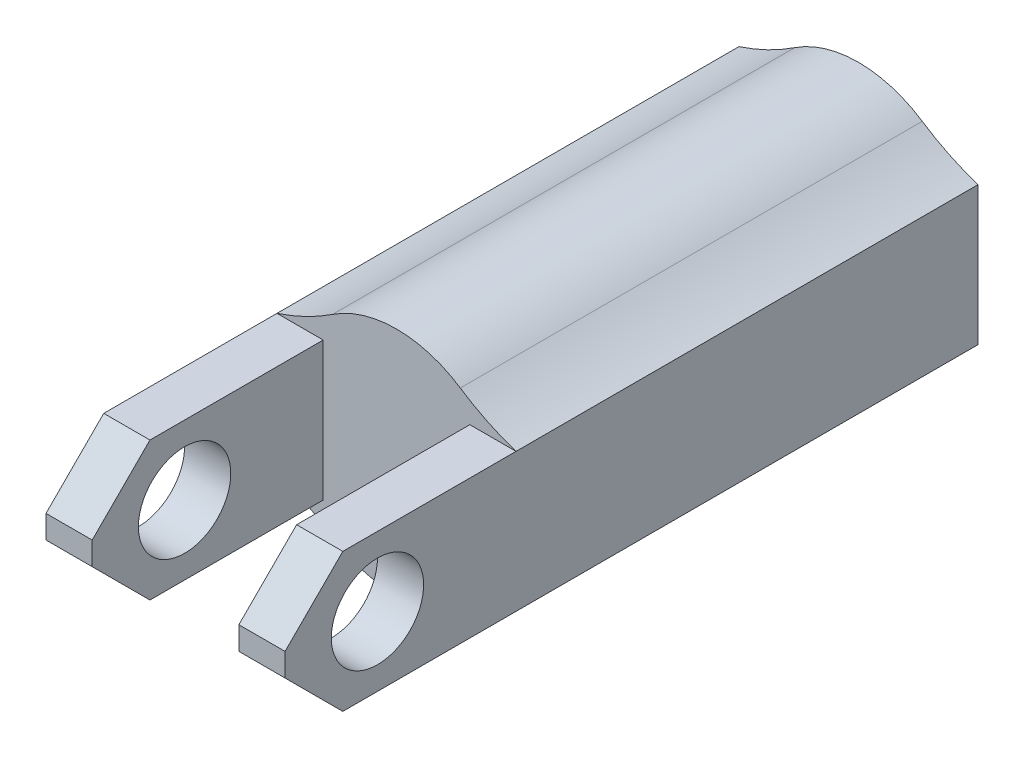
ISO-10303-21;
HEADER;
FILE_DESCRIPTION(('STEP AP214'),'2;1');
FILE_NAME('part.step','',(''),(''),'','','');
FILE_SCHEMA(('AUTOMOTIVE_DESIGN { 1 0 10303 214 1 1 1 1 }'));
ENDSEC;
DATA;
#1=APPLICATION_CONTEXT('core data for automotive mechanical design processes');
#2=APPLICATION_PROTOCOL_DEFINITION('international standard','automotive_design',2000,#1);
#3=PRODUCT_CONTEXT('',#1,'mechanical');
#4=PRODUCT('Part','Part','',(#3));
#5=PRODUCT_RELATED_PRODUCT_CATEGORY('part','',(#4));
#6=PRODUCT_DEFINITION_FORMATION('','',#4);
#7=PRODUCT_DEFINITION_CONTEXT('part definition',#1,'design');
#8=PRODUCT_DEFINITION('design','',#6,#7);
#9=PRODUCT_DEFINITION_SHAPE('','',#8);
#10=(LENGTH_UNIT() NAMED_UNIT(*) SI_UNIT(.MILLI.,.METRE.));
#11=(NAMED_UNIT(*) PLANE_ANGLE_UNIT() SI_UNIT($,.RADIAN.));
#12=(NAMED_UNIT(*) SI_UNIT($,.STERADIAN.) SOLID_ANGLE_UNIT());
#13=UNCERTAINTY_MEASURE_WITH_UNIT(LENGTH_MEASURE(1.E-05),#10,'distance_accuracy_value','');
#14=(GEOMETRIC_REPRESENTATION_CONTEXT(3) GLOBAL_UNCERTAINTY_ASSIGNED_CONTEXT((#13)) GLOBAL_UNIT_ASSIGNED_CONTEXT((#10,
#11,#12)) REPRESENTATION_CONTEXT('',''));
#15=CARTESIAN_POINT('',(0.,0.,0.));
#16=DIRECTION('',(0.,0.,1.));
#17=DIRECTION('',(1.,0.,0.));
#18=AXIS2_PLACEMENT_3D('',#15,#16,#17);
#19=CARTESIAN_POINT('',(0.,0.,20.));
#20=DIRECTION('',(0.,0.,-1.));
#21=DIRECTION('',(-1.,0.,0.));
#22=AXIS2_PLACEMENT_3D('',#19,#20,#21);
#23=CYLINDRICAL_SURFACE('',#22,5.);
#24=CARTESIAN_POINT('',(0.,0.,20.));
#25=DIRECTION('',(0.,0.,1.));
#26=DIRECTION('',(1.,0.,0.));
#27=AXIS2_PLACEMENT_3D('',#24,#25,#26);
#28=CIRCLE('',#27,5.);
#29=CARTESIAN_POINT('',(2.76191629006094,4.16795134408933,20.));
#30=VERTEX_POINT('',#29);
#31=CARTESIAN_POINT('',(-2.76191629006094,4.16795134408933,20.));
#32=VERTEX_POINT('',#31);
#33=EDGE_CURVE('E260',#30,#32,#28,.T.);
#34=ORIENTED_EDGE('',*,*,#33,.F.);
#35=DIRECTION('',(0.,0.,-1.));
#36=VECTOR('',#35,1.);
#37=CARTESIAN_POINT('',(2.76191629006094,4.16795134408933,20.));
#38=LINE('',#37,#36);
#39=CARTESIAN_POINT('',(2.76191629006094,4.16795134408933,0.));
#40=VERTEX_POINT('',#39);
#41=EDGE_CURVE('E203',#30,#40,#38,.T.);
#42=ORIENTED_EDGE('',*,*,#41,.T.);
#43=CARTESIAN_POINT('',(0.,0.,0.));
#44=DIRECTION('',(0.,0.,1.));
#45=DIRECTION('',(1.,0.,0.));
#46=AXIS2_PLACEMENT_3D('',#43,#44,#45);
#47=CIRCLE('',#46,5.);
#48=CARTESIAN_POINT('',(-2.76191629006094,4.16795134408933,0.));
#49=VERTEX_POINT('',#48);
#50=EDGE_CURVE('E259',#40,#49,#47,.T.);
#51=ORIENTED_EDGE('',*,*,#50,.T.);
#52=DIRECTION('',(0.,0.,-1.));
#53=VECTOR('',#52,1.);
#54=CARTESIAN_POINT('',(-2.76191629006094,4.16795134408933,20.));
#55=LINE('',#54,#53);
#56=EDGE_CURVE('E334',#49,#32,#55,.F.);
#57=ORIENTED_EDGE('',*,*,#56,.T.);
#58=EDGE_LOOP('',(#34,#42,#51,#57));
#59=FACE_BOUND('',#58,.T.);
#60=ADVANCED_FACE('F40',(#59),#23,.T.);
#61=CARTESIAN_POINT('',(-2.76191629006094,-4.16795134408933,0.));
#62=VERTEX_POINT('',#61);
#63=CARTESIAN_POINT('',(2.76191629006094,-4.16795134408933,0.));
#64=VERTEX_POINT('',#63);
#65=EDGE_CURVE('E219',#62,#64,#47,.T.);
#66=ORIENTED_EDGE('',*,*,#65,.T.);
#67=DIRECTION('',(0.,0.,-1.));
#68=VECTOR('',#67,1.);
#69=CARTESIAN_POINT('',(2.76191629006094,-4.16795134408933,20.));
#70=LINE('',#69,#68);
#71=CARTESIAN_POINT('',(2.76191629006094,-4.16795134408933,20.));
#72=VERTEX_POINT('',#71);
#73=EDGE_CURVE('E193',#64,#72,#70,.F.);
#74=ORIENTED_EDGE('',*,*,#73,.T.);
#75=CARTESIAN_POINT('',(-2.76191629006094,-4.16795134408933,20.));
#76=VERTEX_POINT('',#75);
#77=EDGE_CURVE('E264',#76,#72,#28,.T.);
#78=ORIENTED_EDGE('',*,*,#77,.F.);
#79=DIRECTION('',(0.,0.,-1.));
#80=VECTOR('',#79,1.);
#81=CARTESIAN_POINT('',(-2.76191629006094,-4.16795134408933,20.));
#82=LINE('',#81,#80);
#83=EDGE_CURVE('E329',#76,#62,#82,.T.);
#84=ORIENTED_EDGE('',*,*,#83,.T.);
#85=EDGE_LOOP('',(#66,#74,#78,#84));
#86=FACE_BOUND('',#85,.T.);
#87=ADVANCED_FACE('F416',(#86),#23,.T.);
#88=CARTESIAN_POINT('',(0.,0.,20.));
#89=DIRECTION('',(0.,0.,1.));
#90=DIRECTION('',(1.,0.,0.));
#91=AXIS2_PLACEMENT_3D('',#88,#89,#90);
#92=PLANE('',#91);
#93=DIRECTION('',(-1.,0.,0.));
#94=VECTOR('',#93,1.);
#95=CARTESIAN_POINT('',(0.,3.,20.));
#96=LINE('',#95,#94);
#97=CARTESIAN_POINT('',(5.175,3.,20.));
#98=VERTEX_POINT('',#97);
#99=CARTESIAN_POINT('',(3.175,3.,20.));
#100=VERTEX_POINT('',#99);
#101=EDGE_CURVE('E350',#98,#100,#96,.T.);
#102=ORIENTED_EDGE('',*,*,#101,.F.);
#103=CARTESIAN_POINT('',(8.28574887018281,12.503854032268,20.));
#104=DIRECTION('',(0.,0.,1.));
#105=DIRECTION('',(1.,0.,0.));
#106=AXIS2_PLACEMENT_3D('',#103,#104,#105);
#107=CIRCLE('',#106,10.);
#108=EDGE_CURVE('E200',#98,#30,#107,.F.);
#109=ORIENTED_EDGE('',*,*,#108,.T.);
#110=ORIENTED_EDGE('',*,*,#33,.T.);
#111=CARTESIAN_POINT('',(-8.28574887018281,12.503854032268,20.));
#112=DIRECTION('',(0.,0.,1.));
#113=DIRECTION('',(1.,0.,0.));
#114=AXIS2_PLACEMENT_3D('',#111,#112,#113);
#115=CIRCLE('',#114,10.);
#116=CARTESIAN_POINT('',(-5.175,3.,20.));
#117=VERTEX_POINT('',#116);
#118=EDGE_CURVE('E209',#32,#117,#115,.F.);
#119=ORIENTED_EDGE('',*,*,#118,.T.);
#120=DIRECTION('',(-1.,0.,0.));
#121=VECTOR('',#120,1.);
#122=CARTESIAN_POINT('',(0.,3.,20.));
#123=LINE('',#122,#121);
#124=CARTESIAN_POINT('',(-3.175,3.,20.));
#125=VERTEX_POINT('',#124);
#126=EDGE_CURVE('E63',#125,#117,#123,.T.);
#127=ORIENTED_EDGE('',*,*,#126,.F.);
#128=DIRECTION('',(0.,1.,0.));
#129=VECTOR('',#128,1.);
#130=CARTESIAN_POINT('',(-3.175,0.,20.));
#131=LINE('',#130,#129);
#132=CARTESIAN_POINT('',(-3.175,-3.,20.));
#133=VERTEX_POINT('',#132);
#134=EDGE_CURVE('E253',#133,#125,#131,.T.);
#135=ORIENTED_EDGE('',*,*,#134,.F.);
#136=DIRECTION('',(1.,0.,0.));
#137=VECTOR('',#136,1.);
#138=CARTESIAN_POINT('',(0.,-3.,20.));
#139=LINE('',#138,#137);
#140=CARTESIAN_POINT('',(-5.175,-3.,20.));
#141=VERTEX_POINT('',#140);
#142=EDGE_CURVE('E55',#141,#133,#139,.T.);
#143=ORIENTED_EDGE('',*,*,#142,.F.);
#144=CARTESIAN_POINT('',(-8.28574887018281,-12.503854032268,20.));
#145=DIRECTION('',(0.,0.,1.));
#146=DIRECTION('',(1.,0.,0.));
#147=AXIS2_PLACEMENT_3D('',#144,#145,#146);
#148=CIRCLE('',#147,10.);
#149=EDGE_CURVE('E11',#141,#76,#148,.F.);
#150=ORIENTED_EDGE('',*,*,#149,.T.);
#151=ORIENTED_EDGE('',*,*,#77,.T.);
#152=CARTESIAN_POINT('',(8.28574887018281,-12.503854032268,20.));
#153=DIRECTION('',(0.,0.,1.));
#154=DIRECTION('',(1.,0.,0.));
#155=AXIS2_PLACEMENT_3D('',#152,#153,#154);
#156=CIRCLE('',#155,10.);
#157=CARTESIAN_POINT('',(5.175,-3.,20.));
#158=VERTEX_POINT('',#157);
#159=EDGE_CURVE('E195',#72,#158,#156,.F.);
#160=ORIENTED_EDGE('',*,*,#159,.T.);
#161=DIRECTION('',(1.,0.,0.));
#162=VECTOR('',#161,1.);
#163=CARTESIAN_POINT('',(0.,-3.,20.));
#164=LINE('',#163,#162);
#165=CARTESIAN_POINT('',(3.175,-3.,20.));
#166=VERTEX_POINT('',#165);
#167=EDGE_CURVE('E371',#166,#158,#164,.T.);
#168=ORIENTED_EDGE('',*,*,#167,.F.);
#169=DIRECTION('',(0.,-1.,0.));
#170=VECTOR('',#169,1.);
#171=CARTESIAN_POINT('',(3.175,0.,20.));
#172=LINE('',#171,#170);
#173=EDGE_CURVE('E177',#100,#166,#172,.T.);
#174=ORIENTED_EDGE('',*,*,#173,.F.);
#175=EDGE_LOOP('',(#102,#109,#110,#119,#127,#135,#143,#150,#151,#160,#168,#174));
#176=FACE_BOUND('',#175,.T.);
#177=ADVANCED_FACE('F348',(#176),#92,.T.);
#178=CARTESIAN_POINT('',(0.,0.,0.));
#179=DIRECTION('',(0.,0.,1.));
#180=DIRECTION('',(1.,0.,0.));
#181=AXIS2_PLACEMENT_3D('',#178,#179,#180);
#182=PLANE('',#181);
#183=CARTESIAN_POINT('',(0.,0.,0.));
#184=DIRECTION('',(0.,0.,-1.));
#185=DIRECTION('',(-1.,0.,0.));
#186=AXIS2_PLACEMENT_3D('',#183,#184,#185);
#187=CIRCLE('',#186,3.);
#188=CARTESIAN_POINT('',(-3.,0.,0.));
#189=VERTEX_POINT('',#188);
#190=EDGE_CURVE('E707',#189,#189,#187,.T.);
#191=ORIENTED_EDGE('',*,*,#190,.F.);
#192=EDGE_LOOP('',(#191));
#193=FACE_BOUND('',#192,.T.);
#194=ORIENTED_EDGE('',*,*,#50,.F.);
#195=CARTESIAN_POINT('',(8.28574887018281,12.503854032268,0.));
#196=DIRECTION('',(0.,0.,1.));
#197=DIRECTION('',(1.,0.,0.));
#198=AXIS2_PLACEMENT_3D('',#195,#196,#197);
#199=CIRCLE('',#198,10.);
#200=CARTESIAN_POINT('',(5.175,3.,0.));
#201=VERTEX_POINT('',#200);
#202=EDGE_CURVE('E172',#40,#201,#199,.T.);
#203=ORIENTED_EDGE('',*,*,#202,.T.);
#204=DIRECTION('',(0.,-1.,0.));
#205=VECTOR('',#204,1.);
#206=CARTESIAN_POINT('',(5.175,3.,0.));
#207=LINE('',#206,#205);
#208=CARTESIAN_POINT('',(5.175,-3.,0.));
#209=VERTEX_POINT('',#208);
#210=EDGE_CURVE('E164',#201,#209,#207,.T.);
#211=ORIENTED_EDGE('',*,*,#210,.T.);
#212=CARTESIAN_POINT('',(8.28574887018281,-12.503854032268,0.));
#213=DIRECTION('',(0.,0.,1.));
#214=DIRECTION('',(1.,0.,0.));
#215=AXIS2_PLACEMENT_3D('',#212,#213,#214);
#216=CIRCLE('',#215,10.);
#217=EDGE_CURVE('E170',#209,#64,#216,.T.);
#218=ORIENTED_EDGE('',*,*,#217,.T.);
#219=ORIENTED_EDGE('',*,*,#65,.F.);
#220=CARTESIAN_POINT('',(-8.28574887018281,-12.503854032268,0.));
#221=DIRECTION('',(0.,0.,1.));
#222=DIRECTION('',(1.,0.,0.));
#223=AXIS2_PLACEMENT_3D('',#220,#221,#222);
#224=CIRCLE('',#223,10.);
#225=CARTESIAN_POINT('',(-5.175,-3.,0.));
#226=VERTEX_POINT('',#225);
#227=EDGE_CURVE('E49',#62,#226,#224,.T.);
#228=ORIENTED_EDGE('',*,*,#227,.T.);
#229=DIRECTION('',(0.,1.,0.));
#230=VECTOR('',#229,1.);
#231=CARTESIAN_POINT('',(-5.175,3.,0.));
#232=LINE('',#231,#230);
#233=CARTESIAN_POINT('',(-5.175,3.,0.));
#234=VERTEX_POINT('',#233);
#235=EDGE_CURVE('E217',#226,#234,#232,.T.);
#236=ORIENTED_EDGE('',*,*,#235,.T.);
#237=CARTESIAN_POINT('',(-8.28574887018281,12.503854032268,0.));
#238=DIRECTION('',(0.,0.,1.));
#239=DIRECTION('',(1.,0.,0.));
#240=AXIS2_PLACEMENT_3D('',#237,#238,#239);
#241=CIRCLE('',#240,10.);
#242=EDGE_CURVE('E212',#234,#49,#241,.T.);
#243=ORIENTED_EDGE('',*,*,#242,.T.);
#244=EDGE_LOOP('',(#194,#203,#211,#218,#219,#228,#236,#243));
#245=FACE_BOUND('',#244,.T.);
#246=ADVANCED_FACE('F167',(#193,#245),#182,.F.);
#247=CARTESIAN_POINT('',(-3.175,3.,-6.32455532033676));
#248=DIRECTION('',(0.,1.,0.));
#249=DIRECTION('',(-1.,0.,0.));
#250=AXIS2_PLACEMENT_3D('',#247,#248,#249);
#251=PLANE('',#250);
#252=ORIENTED_EDGE('',*,*,#126,.T.);
#253=DIRECTION('',(0.,0.,1.));
#254=VECTOR('',#253,1.);
#255=CARTESIAN_POINT('',(-5.175,3.,-6.32455532033676));
#256=LINE('',#255,#254);
#257=CARTESIAN_POINT('',(-5.175,3.,27.5));
#258=VERTEX_POINT('',#257);
#259=EDGE_CURVE('E249',#117,#258,#256,.T.);
#260=ORIENTED_EDGE('',*,*,#259,.T.);
#261=DIRECTION('',(1.,0.,0.));
#262=VECTOR('',#261,1.);
#263=CARTESIAN_POINT('',(-3.175,3.,27.5));
#264=LINE('',#263,#262);
#265=CARTESIAN_POINT('',(-3.175,3.,27.5));
#266=VERTEX_POINT('',#265);
#267=EDGE_CURVE('E316',#258,#266,#264,.T.);
#268=ORIENTED_EDGE('',*,*,#267,.T.);
#269=DIRECTION('',(0.,0.,1.));
#270=VECTOR('',#269,1.);
#271=CARTESIAN_POINT('',(-3.175,3.,-6.32455532033676));
#272=LINE('',#271,#270);
#273=EDGE_CURVE('E235',#125,#266,#272,.T.);
#274=ORIENTED_EDGE('',*,*,#273,.F.);
#275=EDGE_LOOP('',(#252,#260,#268,#274));
#276=FACE_BOUND('',#275,.T.);
#277=ADVANCED_FACE('F405',(#276),#251,.T.);
#278=CARTESIAN_POINT('',(-5.175,-3.,-6.32455532033676));
#279=DIRECTION('',(0.,-1.,0.));
#280=DIRECTION('',(1.,0.,0.));
#281=AXIS2_PLACEMENT_3D('',#278,#279,#280);
#282=PLANE('',#281);
#283=DIRECTION('',(0.,0.,1.));
#284=VECTOR('',#283,1.);
#285=CARTESIAN_POINT('',(-5.175,-3.,-6.32455532033676));
#286=LINE('',#285,#284);
#287=CARTESIAN_POINT('',(-5.175,-3.,27.5));
#288=VERTEX_POINT('',#287);
#289=EDGE_CURVE('E239',#141,#288,#286,.T.);
#290=ORIENTED_EDGE('',*,*,#289,.F.);
#291=ORIENTED_EDGE('',*,*,#142,.T.);
#292=DIRECTION('',(0.,0.,1.));
#293=VECTOR('',#292,1.);
#294=CARTESIAN_POINT('',(-3.175,-3.,-6.32455532033676));
#295=LINE('',#294,#293);
#296=CARTESIAN_POINT('',(-3.175,-3.,27.5));
#297=VERTEX_POINT('',#296);
#298=EDGE_CURVE('E238',#133,#297,#295,.T.);
#299=ORIENTED_EDGE('',*,*,#298,.T.);
#300=DIRECTION('',(-1.,0.,0.));
#301=VECTOR('',#300,1.);
#302=CARTESIAN_POINT('',(-5.175,-3.,27.5));
#303=LINE('',#302,#301);
#304=EDGE_CURVE('E325',#297,#288,#303,.T.);
#305=ORIENTED_EDGE('',*,*,#304,.T.);
#306=EDGE_LOOP('',(#290,#291,#299,#305));
#307=FACE_BOUND('',#306,.T.);
#308=ADVANCED_FACE('F403',(#307),#282,.T.);
#309=CARTESIAN_POINT('',(-3.175,-3.,-6.32455532033676));
#310=DIRECTION('',(1.,0.,0.));
#311=DIRECTION('',(0.,1.,0.));
#312=AXIS2_PLACEMENT_3D('',#309,#310,#311);
#313=PLANE('',#312);
#314=CARTESIAN_POINT('',(-3.175,0.,26.));
#315=DIRECTION('',(1.,0.,0.));
#316=DIRECTION('',(0.,1.,0.));
#317=AXIS2_PLACEMENT_3D('',#314,#315,#316);
#318=CIRCLE('',#317,2.);
#319=CARTESIAN_POINT('',(-3.175,2.,26.));
#320=VERTEX_POINT('',#319);
#321=EDGE_CURVE('E272',#320,#320,#318,.T.);
#322=ORIENTED_EDGE('',*,*,#321,.F.);
#323=EDGE_LOOP('',(#322));
#324=FACE_BOUND('',#323,.T.);
#325=ORIENTED_EDGE('',*,*,#273,.T.);
#326=DIRECTION('',(0.,0.707106781186547,-0.707106781186549));
#327=VECTOR('',#326,1.);
#328=CARTESIAN_POINT('',(-3.175,16.9122776601684,13.5877223398316));
#329=LINE('',#328,#327);
#330=CARTESIAN_POINT('',(-3.175,0.500000000000009,30.));
#331=VERTEX_POINT('',#330);
#332=EDGE_CURVE('E322',#266,#331,#329,.F.);
#333=ORIENTED_EDGE('',*,*,#332,.T.);
#334=DIRECTION('',(0.,1.,0.));
#335=VECTOR('',#334,1.);
#336=CARTESIAN_POINT('',(-3.175,-3.,30.));
#337=LINE('',#336,#335);
#338=CARTESIAN_POINT('',(-3.175,-0.500000000000003,30.));
#339=VERTEX_POINT('',#338);
#340=EDGE_CURVE('E380',#339,#331,#337,.T.);
#341=ORIENTED_EDGE('',*,*,#340,.F.);
#342=DIRECTION('',(0.,0.707106781186547,0.707106781186549));
#343=VECTOR('',#342,1.);
#344=CARTESIAN_POINT('',(-3.175,-19.9122776601684,10.5877223398316));
#345=LINE('',#344,#343);
#346=EDGE_CURVE('E319',#339,#297,#345,.F.);
#347=ORIENTED_EDGE('',*,*,#346,.T.);
#348=ORIENTED_EDGE('',*,*,#298,.F.);
#349=ORIENTED_EDGE('',*,*,#134,.T.);
#350=EDGE_LOOP('',(#325,#333,#341,#347,#348,#349));
#351=FACE_BOUND('',#350,.T.);
#352=ADVANCED_FACE('F388',(#324,#351),#313,.T.);
#353=CARTESIAN_POINT('',(-5.175,3.,-6.32455532033676));
#354=DIRECTION('',(-1.,0.,0.));
#355=DIRECTION('',(0.,-1.,0.));
#356=AXIS2_PLACEMENT_3D('',#353,#354,#355);
#357=PLANE('',#356);
#358=CARTESIAN_POINT('',(-5.175,0.,26.));
#359=DIRECTION('',(-1.,0.,0.));
#360=DIRECTION('',(0.,0.,1.));
#361=AXIS2_PLACEMENT_3D('',#358,#359,#360);
#362=CIRCLE('',#361,2.);
#363=CARTESIAN_POINT('',(-5.175,0.,28.));
#364=VERTEX_POINT('',#363);
#365=EDGE_CURVE('E715',#364,#364,#362,.T.);
#366=ORIENTED_EDGE('',*,*,#365,.F.);
#367=EDGE_LOOP('',(#366));
#368=FACE_BOUND('',#367,.T.);
#369=DIRECTION('',(0.,-1.,0.));
#370=VECTOR('',#369,1.);
#371=CARTESIAN_POINT('',(-5.175,3.,30.));
#372=LINE('',#371,#370);
#373=CARTESIAN_POINT('',(-5.175,0.500000000000007,30.));
#374=VERTEX_POINT('',#373);
#375=CARTESIAN_POINT('',(-5.175,-0.500000000000002,30.));
#376=VERTEX_POINT('',#375);
#377=EDGE_CURVE('E376',#374,#376,#372,.T.);
#378=ORIENTED_EDGE('',*,*,#377,.F.);
#379=DIRECTION('',(0.,-0.707106781186547,0.707106781186549));
#380=VECTOR('',#379,1.);
#381=CARTESIAN_POINT('',(-5.175,19.9122776601684,10.5877223398316));
#382=LINE('',#381,#380);
#383=EDGE_CURVE('E312',#374,#258,#382,.F.);
#384=ORIENTED_EDGE('',*,*,#383,.T.);
#385=ORIENTED_EDGE('',*,*,#259,.F.);
#386=EDGE_CURVE('E232',#234,#117,#256,.T.);
#387=ORIENTED_EDGE('',*,*,#386,.F.);
#388=ORIENTED_EDGE('',*,*,#235,.F.);
#389=EDGE_CURVE('E228',#226,#141,#286,.T.);
#390=ORIENTED_EDGE('',*,*,#389,.T.);
#391=ORIENTED_EDGE('',*,*,#289,.T.);
#392=DIRECTION('',(0.,-0.707106781186547,-0.707106781186549));
#393=VECTOR('',#392,1.);
#394=CARTESIAN_POINT('',(-5.175,-16.9122776601684,13.5877223398316));
#395=LINE('',#394,#393);
#396=EDGE_CURVE('E309',#288,#376,#395,.F.);
#397=ORIENTED_EDGE('',*,*,#396,.T.);
#398=EDGE_LOOP('',(#378,#384,#385,#387,#388,#390,#391,#397));
#399=FACE_BOUND('',#398,.T.);
#400=ADVANCED_FACE('F227',(#368,#399),#357,.T.);
#401=CARTESIAN_POINT('',(0.,0.,30.));
#402=DIRECTION('',(0.,0.,1.));
#403=DIRECTION('',(1.,0.,0.));
#404=AXIS2_PLACEMENT_3D('',#401,#402,#403);
#405=PLANE('',#404);
#406=ORIENTED_EDGE('',*,*,#340,.T.);
#407=DIRECTION('',(-1.,0.,0.));
#408=VECTOR('',#407,1.);
#409=CARTESIAN_POINT('',(0.,0.500000000000011,30.));
#410=LINE('',#409,#408);
#411=EDGE_CURVE('E305',#331,#374,#410,.T.);
#412=ORIENTED_EDGE('',*,*,#411,.T.);
#413=ORIENTED_EDGE('',*,*,#377,.T.);
#414=DIRECTION('',(1.,0.,0.));
#415=VECTOR('',#414,1.);
#416=CARTESIAN_POINT('',(0.,-0.500000000000006,30.));
#417=LINE('',#416,#415);
#418=EDGE_CURVE('E301',#376,#339,#417,.T.);
#419=ORIENTED_EDGE('',*,*,#418,.T.);
#420=EDGE_LOOP('',(#406,#412,#413,#419));
#421=FACE_BOUND('',#420,.T.);
#422=ADVANCED_FACE('F396',(#421),#405,.T.);
#423=CARTESIAN_POINT('',(3.175,3.,-6.32455532033676));
#424=DIRECTION('',(0.,1.,0.));
#425=DIRECTION('',(-1.,0.,0.));
#426=AXIS2_PLACEMENT_3D('',#423,#424,#425);
#427=PLANE('',#426);
#428=DIRECTION('',(0.,0.,1.));
#429=VECTOR('',#428,1.);
#430=CARTESIAN_POINT('',(5.175,3.,-6.32455532033676));
#431=LINE('',#430,#429);
#432=CARTESIAN_POINT('',(5.175,3.,27.5));
#433=VERTEX_POINT('',#432);
#434=EDGE_CURVE('E188',#98,#433,#431,.T.);
#435=ORIENTED_EDGE('',*,*,#434,.F.);
#436=ORIENTED_EDGE('',*,*,#101,.T.);
#437=DIRECTION('',(0.,0.,1.));
#438=VECTOR('',#437,1.);
#439=CARTESIAN_POINT('',(3.175,3.,-6.32455532033676));
#440=LINE('',#439,#438);
#441=CARTESIAN_POINT('',(3.175,3.,27.5));
#442=VERTEX_POINT('',#441);
#443=EDGE_CURVE('E363',#100,#442,#440,.T.);
#444=ORIENTED_EDGE('',*,*,#443,.T.);
#445=DIRECTION('',(1.,0.,0.));
#446=VECTOR('',#445,1.);
#447=CARTESIAN_POINT('',(5.175,3.,27.5));
#448=LINE('',#447,#446);
#449=EDGE_CURVE('E288',#442,#433,#448,.T.);
#450=ORIENTED_EDGE('',*,*,#449,.T.);
#451=EDGE_LOOP('',(#435,#436,#444,#450));
#452=FACE_BOUND('',#451,.T.);
#453=ADVANCED_FACE('F579',(#452),#427,.T.);
#454=CARTESIAN_POINT('',(5.175,-3.,-6.32455532033676));
#455=DIRECTION('',(0.,-1.,0.));
#456=DIRECTION('',(1.,0.,0.));
#457=AXIS2_PLACEMENT_3D('',#454,#455,#456);
#458=PLANE('',#457);
#459=ORIENTED_EDGE('',*,*,#167,.T.);
#460=DIRECTION('',(0.,0.,1.));
#461=VECTOR('',#460,1.);
#462=CARTESIAN_POINT('',(5.175,-3.,-6.32455532033676));
#463=LINE('',#462,#461);
#464=CARTESIAN_POINT('',(5.175,-3.,27.5));
#465=VERTEX_POINT('',#464);
#466=EDGE_CURVE('E185',#158,#465,#463,.T.);
#467=ORIENTED_EDGE('',*,*,#466,.T.);
#468=DIRECTION('',(-1.,0.,0.));
#469=VECTOR('',#468,1.);
#470=CARTESIAN_POINT('',(3.175,-3.,27.5));
#471=LINE('',#470,#469);
#472=CARTESIAN_POINT('',(3.175,-3.,27.5));
#473=VERTEX_POINT('',#472);
#474=EDGE_CURVE('E298',#465,#473,#471,.T.);
#475=ORIENTED_EDGE('',*,*,#474,.T.);
#476=DIRECTION('',(0.,0.,1.));
#477=VECTOR('',#476,1.);
#478=CARTESIAN_POINT('',(3.175,-3.,-6.32455532033676));
#479=LINE('',#478,#477);
#480=EDGE_CURVE('E359',#166,#473,#479,.T.);
#481=ORIENTED_EDGE('',*,*,#480,.F.);
#482=EDGE_LOOP('',(#459,#467,#475,#481));
#483=FACE_BOUND('',#482,.T.);
#484=ADVANCED_FACE('F569',(#483),#458,.T.);
#485=CARTESIAN_POINT('',(5.175,3.,-6.32455532033676));
#486=DIRECTION('',(1.,0.,0.));
#487=DIRECTION('',(0.,1.,0.));
#488=AXIS2_PLACEMENT_3D('',#485,#486,#487);
#489=PLANE('',#488);
#490=CARTESIAN_POINT('',(5.175,0.,26.));
#491=DIRECTION('',(-1.,0.,0.));
#492=DIRECTION('',(0.,0.,1.));
#493=AXIS2_PLACEMENT_3D('',#490,#491,#492);
#494=CIRCLE('',#493,2.);
#495=CARTESIAN_POINT('',(5.175,0.,28.));
#496=VERTEX_POINT('',#495);
#497=EDGE_CURVE('E273',#496,#496,#494,.T.);
#498=ORIENTED_EDGE('',*,*,#497,.T.);
#499=EDGE_LOOP('',(#498));
#500=FACE_BOUND('',#499,.T.);
#501=EDGE_CURVE('E178',#201,#98,#431,.T.);
#502=ORIENTED_EDGE('',*,*,#501,.T.);
#503=ORIENTED_EDGE('',*,*,#434,.T.);
#504=DIRECTION('',(0.,-0.707106781186547,0.707106781186548));
#505=VECTOR('',#504,1.);
#506=CARTESIAN_POINT('',(5.175,19.9122776601684,10.5877223398316));
#507=LINE('',#506,#505);
#508=CARTESIAN_POINT('',(5.175,0.500000000000002,30.));
#509=VERTEX_POINT('',#508);
#510=EDGE_CURVE('E295',#433,#509,#507,.T.);
#511=ORIENTED_EDGE('',*,*,#510,.T.);
#512=DIRECTION('',(0.,1.,0.));
#513=VECTOR('',#512,1.);
#514=CARTESIAN_POINT('',(5.175,3.,30.));
#515=LINE('',#514,#513);
#516=CARTESIAN_POINT('',(5.175,-0.500000000000002,30.));
#517=VERTEX_POINT('',#516);
#518=EDGE_CURVE('E367',#517,#509,#515,.T.);
#519=ORIENTED_EDGE('',*,*,#518,.F.);
#520=DIRECTION('',(0.,-0.707106781186547,-0.707106781186549));
#521=VECTOR('',#520,1.);
#522=CARTESIAN_POINT('',(5.175,-16.9122776601684,13.5877223398316));
#523=LINE('',#522,#521);
#524=EDGE_CURVE('E292',#517,#465,#523,.T.);
#525=ORIENTED_EDGE('',*,*,#524,.T.);
#526=ORIENTED_EDGE('',*,*,#466,.F.);
#527=EDGE_CURVE('E182',#209,#158,#463,.T.);
#528=ORIENTED_EDGE('',*,*,#527,.F.);
#529=ORIENTED_EDGE('',*,*,#210,.F.);
#530=EDGE_LOOP('',(#502,#503,#511,#519,#525,#526,#528,#529));
#531=FACE_BOUND('',#530,.T.);
#532=ADVANCED_FACE('F183',(#500,#531),#489,.T.);
#533=CARTESIAN_POINT('',(3.175,-3.,-6.32455532033676));
#534=DIRECTION('',(-1.,0.,0.));
#535=DIRECTION('',(0.,-1.,0.));
#536=AXIS2_PLACEMENT_3D('',#533,#534,#535);
#537=PLANE('',#536);
#538=CARTESIAN_POINT('',(3.175,0.,26.));
#539=DIRECTION('',(-1.,0.,0.));
#540=DIRECTION('',(0.,-1.,0.));
#541=AXIS2_PLACEMENT_3D('',#538,#539,#540);
#542=CIRCLE('',#541,2.);
#543=CARTESIAN_POINT('',(3.175,-2.,26.));
#544=VERTEX_POINT('',#543);
#545=EDGE_CURVE('E268',#544,#544,#542,.T.);
#546=ORIENTED_EDGE('',*,*,#545,.F.);
#547=EDGE_LOOP('',(#546));
#548=FACE_BOUND('',#547,.T.);
#549=DIRECTION('',(0.,-1.,0.));
#550=VECTOR('',#549,1.);
#551=CARTESIAN_POINT('',(3.175,-3.,30.));
#552=LINE('',#551,#550);
#553=CARTESIAN_POINT('',(3.175,0.500000000000003,30.));
#554=VERTEX_POINT('',#553);
#555=CARTESIAN_POINT('',(3.175,-0.500000000000003,30.));
#556=VERTEX_POINT('',#555);
#557=EDGE_CURVE('E727',#554,#556,#552,.T.);
#558=ORIENTED_EDGE('',*,*,#557,.F.);
#559=DIRECTION('',(0.,0.707106781186547,-0.707106781186548));
#560=VECTOR('',#559,1.);
#561=CARTESIAN_POINT('',(3.175,16.9122776601684,13.5877223398316));
#562=LINE('',#561,#560);
#563=EDGE_CURVE('E285',#554,#442,#562,.T.);
#564=ORIENTED_EDGE('',*,*,#563,.T.);
#565=ORIENTED_EDGE('',*,*,#443,.F.);
#566=ORIENTED_EDGE('',*,*,#173,.T.);
#567=ORIENTED_EDGE('',*,*,#480,.T.);
#568=DIRECTION('',(0.,0.707106781186547,0.707106781186549));
#569=VECTOR('',#568,1.);
#570=CARTESIAN_POINT('',(3.175,-19.9122776601684,10.5877223398316));
#571=LINE('',#570,#569);
#572=EDGE_CURVE('E282',#473,#556,#571,.T.);
#573=ORIENTED_EDGE('',*,*,#572,.T.);
#574=EDGE_LOOP('',(#558,#564,#565,#566,#567,#573));
#575=FACE_BOUND('',#574,.T.);
#576=ADVANCED_FACE('F550',(#548,#575),#537,.T.);
#577=CARTESIAN_POINT('',(0.,0.,30.));
#578=DIRECTION('',(0.,0.,-1.));
#579=DIRECTION('',(-1.,0.,0.));
#580=AXIS2_PLACEMENT_3D('',#577,#578,#579);
#581=PLANE('',#580);
#582=ORIENTED_EDGE('',*,*,#518,.T.);
#583=DIRECTION('',(-1.,0.,0.));
#584=VECTOR('',#583,1.);
#585=CARTESIAN_POINT('',(3.175,0.500000000000003,30.));
#586=LINE('',#585,#584);
#587=EDGE_CURVE('E278',#509,#554,#586,.T.);
#588=ORIENTED_EDGE('',*,*,#587,.T.);
#589=ORIENTED_EDGE('',*,*,#557,.T.);
#590=DIRECTION('',(1.,0.,0.));
#591=VECTOR('',#590,1.);
#592=CARTESIAN_POINT('',(5.175,-0.500000000000002,30.));
#593=LINE('',#592,#591);
#594=EDGE_CURVE('E274',#556,#517,#593,.T.);
#595=ORIENTED_EDGE('',*,*,#594,.T.);
#596=EDGE_LOOP('',(#582,#588,#589,#595));
#597=FACE_BOUND('',#596,.T.);
#598=ADVANCED_FACE('F542',(#597),#581,.F.);
#599=CARTESIAN_POINT('',(5.175,0.,26.));
#600=DIRECTION('',(-1.,0.,0.));
#601=DIRECTION('',(0.,0.,1.));
#602=AXIS2_PLACEMENT_3D('',#599,#600,#601);
#603=CYLINDRICAL_SURFACE('',#602,2.);
#604=ORIENTED_EDGE('',*,*,#545,.T.);
#605=EDGE_LOOP('',(#604));
#606=FACE_BOUND('',#605,.T.);
#607=ORIENTED_EDGE('',*,*,#497,.F.);
#608=EDGE_LOOP('',(#607));
#609=FACE_BOUND('',#608,.T.);
#610=ADVANCED_FACE('F531',(#606,#609),#603,.F.);
#611=ORIENTED_EDGE('',*,*,#321,.T.);
#612=EDGE_LOOP('',(#611));
#613=FACE_BOUND('',#612,.T.);
#614=ORIENTED_EDGE('',*,*,#365,.T.);
#615=EDGE_LOOP('',(#614));
#616=FACE_BOUND('',#615,.T.);
#617=ADVANCED_FACE('F433',(#613,#616),#603,.F.);
#618=CARTESIAN_POINT('',(0.,0.500000000000005,30.));
#619=DIRECTION('',(0.,0.707106781186548,0.707106781186547));
#620=DIRECTION('',(1.,0.,0.));
#621=AXIS2_PLACEMENT_3D('',#618,#619,#620);
#622=PLANE('',#621);
#623=ORIENTED_EDGE('',*,*,#510,.F.);
#624=ORIENTED_EDGE('',*,*,#449,.F.);
#625=ORIENTED_EDGE('',*,*,#563,.F.);
#626=ORIENTED_EDGE('',*,*,#587,.F.);
#627=EDGE_LOOP('',(#623,#624,#625,#626));
#628=FACE_BOUND('',#627,.T.);
#629=ADVANCED_FACE('F426',(#628),#622,.T.);
#630=CARTESIAN_POINT('',(0.,-0.500000000000006,30.));
#631=DIRECTION('',(0.,-0.707106781186548,0.707106781186546));
#632=DIRECTION('',(-1.,0.,0.));
#633=AXIS2_PLACEMENT_3D('',#630,#631,#632);
#634=PLANE('',#633);
#635=ORIENTED_EDGE('',*,*,#572,.F.);
#636=ORIENTED_EDGE('',*,*,#474,.F.);
#637=ORIENTED_EDGE('',*,*,#524,.F.);
#638=ORIENTED_EDGE('',*,*,#594,.F.);
#639=EDGE_LOOP('',(#635,#636,#637,#638));
#640=FACE_BOUND('',#639,.T.);
#641=ADVANCED_FACE('F432',(#640),#634,.T.);
#642=CARTESIAN_POINT('',(0.,0.500000000000011,30.));
#643=DIRECTION('',(0.,-0.707106781186549,-0.707106781186547));
#644=DIRECTION('',(-1.,0.,0.));
#645=AXIS2_PLACEMENT_3D('',#642,#643,#644);
#646=PLANE('',#645);
#647=ORIENTED_EDGE('',*,*,#332,.F.);
#648=ORIENTED_EDGE('',*,*,#267,.F.);
#649=ORIENTED_EDGE('',*,*,#383,.F.);
#650=ORIENTED_EDGE('',*,*,#411,.F.);
#651=EDGE_LOOP('',(#647,#648,#649,#650));
#652=FACE_BOUND('',#651,.T.);
#653=ADVANCED_FACE('F394',(#652),#646,.F.);
#654=CARTESIAN_POINT('',(0.,-0.500000000000006,30.));
#655=DIRECTION('',(0.,0.707106781186548,-0.707106781186546));
#656=DIRECTION('',(1.,0.,0.));
#657=AXIS2_PLACEMENT_3D('',#654,#655,#656);
#658=PLANE('',#657);
#659=ORIENTED_EDGE('',*,*,#396,.F.);
#660=ORIENTED_EDGE('',*,*,#304,.F.);
#661=ORIENTED_EDGE('',*,*,#346,.F.);
#662=ORIENTED_EDGE('',*,*,#418,.F.);
#663=EDGE_LOOP('',(#659,#660,#661,#662));
#664=FACE_BOUND('',#663,.T.);
#665=ADVANCED_FACE('F401',(#664),#658,.F.);
#666=CARTESIAN_POINT('',(0.,0.,15.));
#667=DIRECTION('',(0.,0.,-1.));
#668=DIRECTION('',(-1.,0.,0.));
#669=AXIS2_PLACEMENT_3D('',#666,#667,#668);
#670=CYLINDRICAL_SURFACE('',#669,3.);
#671=CARTESIAN_POINT('',(0.,0.,15.));
#672=DIRECTION('',(0.,0.,-1.));
#673=DIRECTION('',(-1.,0.,0.));
#674=AXIS2_PLACEMENT_3D('',#671,#672,#673);
#675=CIRCLE('',#674,3.);
#676=CARTESIAN_POINT('',(-3.,0.,15.));
#677=VERTEX_POINT('',#676);
#678=EDGE_CURVE('E710',#677,#677,#675,.T.);
#679=ORIENTED_EDGE('',*,*,#678,.F.);
#680=EDGE_LOOP('',(#679));
#681=FACE_BOUND('',#680,.T.);
#682=ORIENTED_EDGE('',*,*,#190,.T.);
#683=EDGE_LOOP('',(#682));
#684=FACE_BOUND('',#683,.T.);
#685=ADVANCED_FACE('F450',(#681,#684),#670,.F.);
#686=CARTESIAN_POINT('',(0.,0.,15.));
#687=DIRECTION('',(0.,0.,-1.));
#688=DIRECTION('',(-1.,0.,0.));
#689=AXIS2_PLACEMENT_3D('',#686,#687,#688);
#690=PLANE('',#689);
#691=ORIENTED_EDGE('',*,*,#678,.T.);
#692=EDGE_LOOP('',(#691));
#693=FACE_BOUND('',#692,.T.);
#694=ADVANCED_FACE('F453',(#693),#690,.T.);
#695=CARTESIAN_POINT('',(8.28574887018281,-12.503854032268,-6.32455532033676));
#696=DIRECTION('',(0.,0.,-1.));
#697=DIRECTION('',(-1.,0.,0.));
#698=AXIS2_PLACEMENT_3D('',#695,#696,#697);
#699=CYLINDRICAL_SURFACE('',#698,10.);
#700=ORIENTED_EDGE('',*,*,#217,.F.);
#701=ORIENTED_EDGE('',*,*,#527,.T.);
#702=ORIENTED_EDGE('',*,*,#159,.F.);
#703=ORIENTED_EDGE('',*,*,#73,.F.);
#704=EDGE_LOOP('',(#700,#701,#702,#703));
#705=FACE_BOUND('',#704,.T.);
#706=ADVANCED_FACE('F191',(#705),#699,.F.);
#707=CARTESIAN_POINT('',(8.28574887018281,12.503854032268,-6.32455532033676));
#708=DIRECTION('',(0.,0.,1.));
#709=DIRECTION('',(1.,0.,0.));
#710=AXIS2_PLACEMENT_3D('',#707,#708,#709);
#711=CYLINDRICAL_SURFACE('',#710,10.);
#712=ORIENTED_EDGE('',*,*,#108,.F.);
#713=ORIENTED_EDGE('',*,*,#501,.F.);
#714=ORIENTED_EDGE('',*,*,#202,.F.);
#715=ORIENTED_EDGE('',*,*,#41,.F.);
#716=EDGE_LOOP('',(#712,#713,#714,#715));
#717=FACE_BOUND('',#716,.T.);
#718=ADVANCED_FACE('F352',(#717),#711,.F.);
#719=CARTESIAN_POINT('',(-8.28574887018281,12.503854032268,-6.32455532033676));
#720=DIRECTION('',(0.,0.,-1.));
#721=DIRECTION('',(-1.,0.,0.));
#722=AXIS2_PLACEMENT_3D('',#719,#720,#721);
#723=CYLINDRICAL_SURFACE('',#722,10.);
#724=ORIENTED_EDGE('',*,*,#242,.F.);
#725=ORIENTED_EDGE('',*,*,#386,.T.);
#726=ORIENTED_EDGE('',*,*,#118,.F.);
#727=ORIENTED_EDGE('',*,*,#56,.F.);
#728=EDGE_LOOP('',(#724,#725,#726,#727));
#729=FACE_BOUND('',#728,.T.);
#730=ADVANCED_FACE('F347',(#729),#723,.F.);
#731=CARTESIAN_POINT('',(-8.28574887018281,-12.503854032268,-6.32455532033676));
#732=DIRECTION('',(0.,0.,1.));
#733=DIRECTION('',(1.,0.,0.));
#734=AXIS2_PLACEMENT_3D('',#731,#732,#733);
#735=CYLINDRICAL_SURFACE('',#734,10.);
#736=ORIENTED_EDGE('',*,*,#149,.F.);
#737=ORIENTED_EDGE('',*,*,#389,.F.);
#738=ORIENTED_EDGE('',*,*,#227,.F.);
#739=ORIENTED_EDGE('',*,*,#83,.F.);
#740=EDGE_LOOP('',(#736,#737,#738,#739));
#741=FACE_BOUND('',#740,.T.);
#742=ADVANCED_FACE('F42',(#741),#735,.F.);
#743=CLOSED_SHELL('',(#60,#87,#177,#246,#277,#308,#352,#400,#422,#453,#484,#532,#576,#598,#610,
#617,#629,#641,#653,#665,#685,#694,#706,#718,#730,#742));
#744=MANIFOLD_SOLID_BREP('B2',#743);
#745=ADVANCED_BREP_SHAPE_REPRESENTATION('',(#18,#744),#14);
#746=SHAPE_DEFINITION_REPRESENTATION(#9,#745);
ENDSEC;
END-ISO-10303-21;
